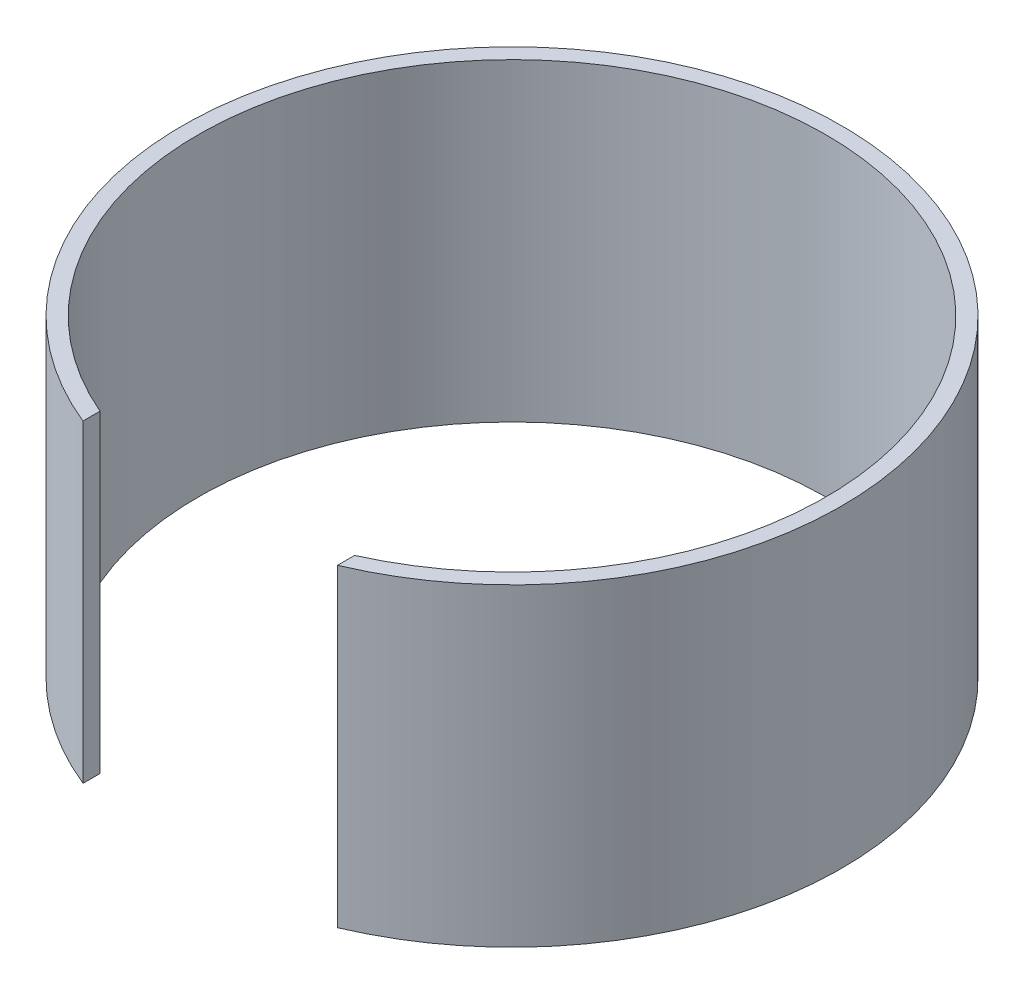
ISO-10303-21;
HEADER;
FILE_DESCRIPTION(('STEP AP214'),'2;1');
FILE_NAME('part.step','',(''),(''),'','','');
FILE_SCHEMA(('AUTOMOTIVE_DESIGN { 1 0 10303 214 1 1 1 1 }'));
ENDSEC;
DATA;
#1=APPLICATION_CONTEXT('core data for automotive mechanical design processes');
#2=APPLICATION_PROTOCOL_DEFINITION('international standard','automotive_design',2000,#1);
#3=PRODUCT_CONTEXT('',#1,'mechanical');
#4=PRODUCT('Part','Part','',(#3));
#5=PRODUCT_RELATED_PRODUCT_CATEGORY('part','',(#4));
#6=PRODUCT_DEFINITION_FORMATION('','',#4);
#7=PRODUCT_DEFINITION_CONTEXT('part definition',#1,'design');
#8=PRODUCT_DEFINITION('design','',#6,#7);
#9=PRODUCT_DEFINITION_SHAPE('','',#8);
#10=(LENGTH_UNIT() NAMED_UNIT(*) SI_UNIT(.MILLI.,.METRE.));
#11=(NAMED_UNIT(*) PLANE_ANGLE_UNIT() SI_UNIT($,.RADIAN.));
#12=(NAMED_UNIT(*) SI_UNIT($,.STERADIAN.) SOLID_ANGLE_UNIT());
#13=UNCERTAINTY_MEASURE_WITH_UNIT(LENGTH_MEASURE(1.E-05),#10,'distance_accuracy_value','');
#14=(GEOMETRIC_REPRESENTATION_CONTEXT(3) GLOBAL_UNCERTAINTY_ASSIGNED_CONTEXT((#13)) GLOBAL_UNIT_ASSIGNED_CONTEXT((#10,
#11,#12)) REPRESENTATION_CONTEXT('',''));
#15=CARTESIAN_POINT('',(0.,0.,0.));
#16=DIRECTION('',(0.,0.,1.));
#17=DIRECTION('',(1.,0.,0.));
#18=AXIS2_PLACEMENT_3D('',#15,#16,#17);
#19=CARTESIAN_POINT('',(0.,100.,0.));
#20=DIRECTION('',(0.,-1.,0.));
#21=DIRECTION('',(0.,0.,-1.));
#22=AXIS2_PLACEMENT_3D('',#19,#20,#21);
#23=CYLINDRICAL_SURFACE('',#22,100.);
#24=CARTESIAN_POINT('',(0.,0.,0.));
#25=DIRECTION('',(0.,-1.,0.));
#26=DIRECTION('',(0.,0.,1.));
#27=AXIS2_PLACEMENT_3D('',#24,#25,#26);
#28=CIRCLE('',#27,100.);
#29=CARTESIAN_POINT('',(-39.3306625055463,0.,91.9407362754662));
#30=VERTEX_POINT('',#29);
#31=CARTESIAN_POINT('',(41.0297764304292,0.,91.1951613084214));
#32=VERTEX_POINT('',#31);
#33=EDGE_CURVE('E96',#30,#32,#28,.T.);
#34=ORIENTED_EDGE('',*,*,#33,.T.);
#35=DIRECTION('',(0.,-1.,0.));
#36=VECTOR('',#35,1.);
#37=CARTESIAN_POINT('',(41.0297764304292,100.,91.1951613084214));
#38=LINE('',#37,#36);
#39=CARTESIAN_POINT('',(41.0297764304292,100.,91.1951613084214));
#40=VERTEX_POINT('',#39);
#41=EDGE_CURVE('E11',#40,#32,#38,.T.);
#42=ORIENTED_EDGE('',*,*,#41,.F.);
#43=CARTESIAN_POINT('',(0.,100.,0.));
#44=DIRECTION('',(0.,-1.,0.));
#45=DIRECTION('',(0.,0.,1.));
#46=AXIS2_PLACEMENT_3D('',#43,#44,#45);
#47=CIRCLE('',#46,100.);
#48=CARTESIAN_POINT('',(-39.3306625055463,100.,91.9407362754662));
#49=VERTEX_POINT('',#48);
#50=EDGE_CURVE('E84',#49,#40,#47,.T.);
#51=ORIENTED_EDGE('',*,*,#50,.F.);
#52=DIRECTION('',(0.,-1.,0.));
#53=VECTOR('',#52,1.);
#54=CARTESIAN_POINT('',(-39.3306625055463,100.,91.9407362754662));
#55=LINE('',#54,#53);
#56=EDGE_CURVE('E92',#49,#30,#55,.T.);
#57=ORIENTED_EDGE('',*,*,#56,.T.);
#58=EDGE_LOOP('',(#34,#42,#51,#57));
#59=FACE_BOUND('',#58,.T.);
#60=ADVANCED_FACE('F33',(#59),#23,.F.);
#61=CARTESIAN_POINT('',(41.0297764304292,100.,96.6517327628895));
#62=DIRECTION('',(1.,0.,0.));
#63=DIRECTION('',(0.,0.,-1.));
#64=AXIS2_PLACEMENT_3D('',#61,#62,#63);
#65=PLANE('',#64);
#66=DIRECTION('',(0.,0.,1.));
#67=VECTOR('',#66,1.);
#68=CARTESIAN_POINT('',(41.0297764304292,0.,96.6517327628895));
#69=LINE('',#68,#67);
#70=CARTESIAN_POINT('',(41.0297764304292,0.,96.6517327628895));
#71=VERTEX_POINT('',#70);
#72=EDGE_CURVE('E88',#32,#71,#69,.T.);
#73=ORIENTED_EDGE('',*,*,#72,.T.);
#74=DIRECTION('',(0.,-1.,0.));
#75=VECTOR('',#74,1.);
#76=CARTESIAN_POINT('',(41.0297764304292,100.,96.6517327628895));
#77=LINE('',#76,#75);
#78=CARTESIAN_POINT('',(41.0297764304292,100.,96.6517327628895));
#79=VERTEX_POINT('',#78);
#80=EDGE_CURVE('E41',#79,#71,#77,.T.);
#81=ORIENTED_EDGE('',*,*,#80,.F.);
#82=DIRECTION('',(0.,0.,1.));
#83=VECTOR('',#82,1.);
#84=CARTESIAN_POINT('',(41.0297764304292,100.,96.6517327628895));
#85=LINE('',#84,#83);
#86=EDGE_CURVE('E79',#40,#79,#85,.T.);
#87=ORIENTED_EDGE('',*,*,#86,.F.);
#88=ORIENTED_EDGE('',*,*,#41,.T.);
#89=EDGE_LOOP('',(#73,#81,#87,#88));
#90=FACE_BOUND('',#89,.T.);
#91=ADVANCED_FACE('F87',(#90),#65,.F.);
#92=CARTESIAN_POINT('',(0.,100.,0.));
#93=DIRECTION('',(0.,-1.,0.));
#94=DIRECTION('',(0.,0.,-1.));
#95=AXIS2_PLACEMENT_3D('',#92,#93,#94);
#96=CYLINDRICAL_SURFACE('',#95,105.);
#97=CARTESIAN_POINT('',(0.,0.,0.));
#98=DIRECTION('',(0.,1.,0.));
#99=DIRECTION('',(0.,0.,1.));
#100=AXIS2_PLACEMENT_3D('',#97,#98,#99);
#101=CIRCLE('',#100,105.);
#102=CARTESIAN_POINT('',(-39.3306625055463,0.,97.3555287945929));
#103=VERTEX_POINT('',#102);
#104=EDGE_CURVE('E66',#71,#103,#101,.T.);
#105=ORIENTED_EDGE('',*,*,#104,.T.);
#106=DIRECTION('',(0.,-1.,0.));
#107=VECTOR('',#106,1.);
#108=CARTESIAN_POINT('',(-39.3306625055463,100.,97.3555287945929));
#109=LINE('',#108,#107);
#110=CARTESIAN_POINT('',(-39.3306625055463,100.,97.3555287945929));
#111=VERTEX_POINT('',#110);
#112=EDGE_CURVE('E89',#111,#103,#109,.T.);
#113=ORIENTED_EDGE('',*,*,#112,.F.);
#114=CARTESIAN_POINT('',(0.,100.,0.));
#115=DIRECTION('',(0.,1.,0.));
#116=DIRECTION('',(0.,0.,1.));
#117=AXIS2_PLACEMENT_3D('',#114,#115,#116);
#118=CIRCLE('',#117,105.);
#119=EDGE_CURVE('E82',#79,#111,#118,.T.);
#120=ORIENTED_EDGE('',*,*,#119,.F.);
#121=ORIENTED_EDGE('',*,*,#80,.T.);
#122=EDGE_LOOP('',(#105,#113,#120,#121));
#123=FACE_BOUND('',#122,.T.);
#124=ADVANCED_FACE('F90',(#123),#96,.T.);
#125=CARTESIAN_POINT('',(-39.3306625055463,100.,97.3555287945929));
#126=DIRECTION('',(-1.,0.,0.));
#127=DIRECTION('',(0.,0.,1.));
#128=AXIS2_PLACEMENT_3D('',#125,#126,#127);
#129=PLANE('',#128);
#130=DIRECTION('',(0.,0.,-1.));
#131=VECTOR('',#130,1.);
#132=CARTESIAN_POINT('',(-39.3306625055463,0.,97.3555287945929));
#133=LINE('',#132,#131);
#134=EDGE_CURVE('E72',#103,#30,#133,.T.);
#135=ORIENTED_EDGE('',*,*,#134,.T.);
#136=ORIENTED_EDGE('',*,*,#56,.F.);
#137=DIRECTION('',(0.,0.,-1.));
#138=VECTOR('',#137,1.);
#139=CARTESIAN_POINT('',(-39.3306625055463,100.,97.3555287945929));
#140=LINE('',#139,#138);
#141=EDGE_CURVE('E49',#111,#49,#140,.T.);
#142=ORIENTED_EDGE('',*,*,#141,.F.);
#143=ORIENTED_EDGE('',*,*,#112,.T.);
#144=EDGE_LOOP('',(#135,#136,#142,#143));
#145=FACE_BOUND('',#144,.T.);
#146=ADVANCED_FACE('F103',(#145),#129,.F.);
#147=CARTESIAN_POINT('',(0.,100.,0.));
#148=DIRECTION('',(0.,1.,0.));
#149=DIRECTION('',(0.,0.,1.));
#150=AXIS2_PLACEMENT_3D('',#147,#148,#149);
#151=PLANE('',#150);
#152=ORIENTED_EDGE('',*,*,#50,.T.);
#153=ORIENTED_EDGE('',*,*,#86,.T.);
#154=ORIENTED_EDGE('',*,*,#119,.T.);
#155=ORIENTED_EDGE('',*,*,#141,.T.);
#156=EDGE_LOOP('',(#152,#153,#154,#155));
#157=FACE_BOUND('',#156,.T.);
#158=ADVANCED_FACE('F80',(#157),#151,.T.);
#159=CARTESIAN_POINT('',(0.,0.,0.));
#160=DIRECTION('',(0.,1.,0.));
#161=DIRECTION('',(0.,0.,1.));
#162=AXIS2_PLACEMENT_3D('',#159,#160,#161);
#163=PLANE('',#162);
#164=ORIENTED_EDGE('',*,*,#33,.F.);
#165=ORIENTED_EDGE('',*,*,#134,.F.);
#166=ORIENTED_EDGE('',*,*,#104,.F.);
#167=ORIENTED_EDGE('',*,*,#72,.F.);
#168=EDGE_LOOP('',(#164,#165,#166,#167));
#169=FACE_BOUND('',#168,.T.);
#170=ADVANCED_FACE('F106',(#169),#163,.F.);
#171=CLOSED_SHELL('',(#60,#91,#124,#146,#158,#170));
#172=MANIFOLD_SOLID_BREP('B2',#171);
#173=ADVANCED_BREP_SHAPE_REPRESENTATION('',(#18,#172),#14);
#174=SHAPE_DEFINITION_REPRESENTATION(#9,#173);
ENDSEC;
END-ISO-10303-21;
